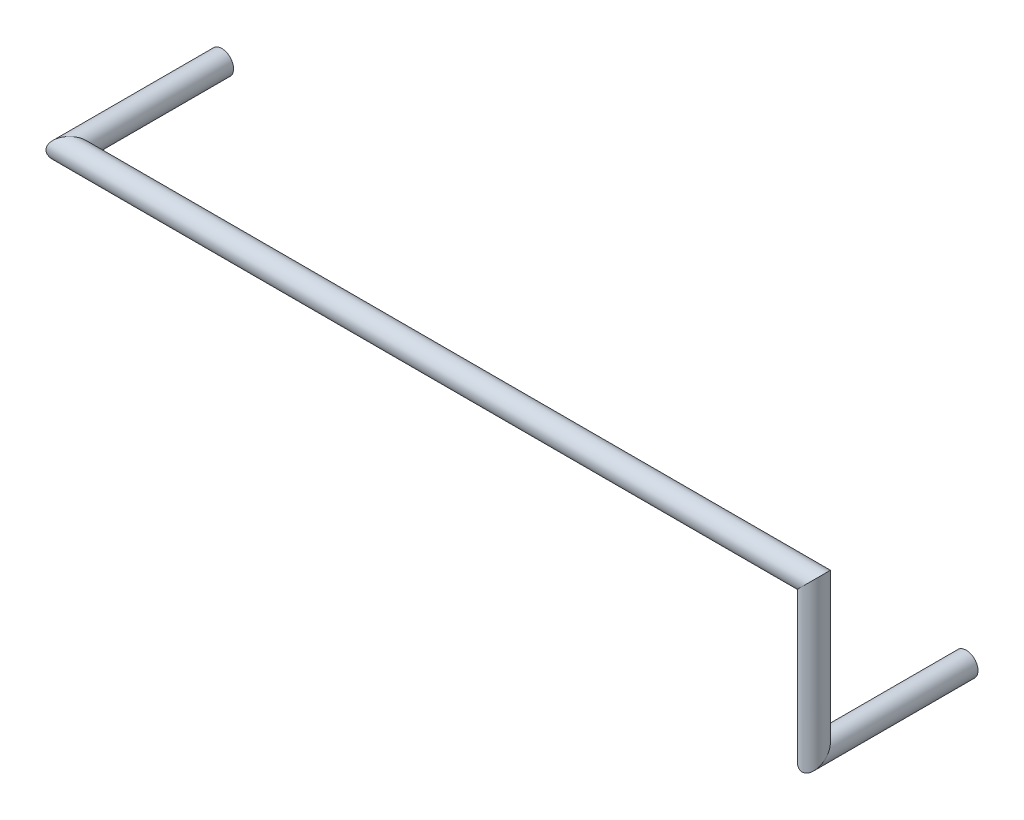
ISO-10303-21;
HEADER;
FILE_DESCRIPTION(('STEP AP214'),'2;1');
FILE_NAME('part.step','',(''),(''),'','','');
FILE_SCHEMA(('AUTOMOTIVE_DESIGN { 1 0 10303 214 1 1 1 1 }'));
ENDSEC;
DATA;
#1=APPLICATION_CONTEXT('core data for automotive mechanical design processes');
#2=APPLICATION_PROTOCOL_DEFINITION('international standard','automotive_design',2000,#1);
#3=PRODUCT_CONTEXT('',#1,'mechanical');
#4=PRODUCT('Part','Part','',(#3));
#5=PRODUCT_RELATED_PRODUCT_CATEGORY('part','',(#4));
#6=PRODUCT_DEFINITION_FORMATION('','',#4);
#7=PRODUCT_DEFINITION_CONTEXT('part definition',#1,'design');
#8=PRODUCT_DEFINITION('design','',#6,#7);
#9=PRODUCT_DEFINITION_SHAPE('','',#8);
#10=(LENGTH_UNIT() NAMED_UNIT(*) SI_UNIT(.MILLI.,.METRE.));
#11=(NAMED_UNIT(*) PLANE_ANGLE_UNIT() SI_UNIT($,.RADIAN.));
#12=(NAMED_UNIT(*) SI_UNIT($,.STERADIAN.) SOLID_ANGLE_UNIT());
#13=UNCERTAINTY_MEASURE_WITH_UNIT(LENGTH_MEASURE(1.E-05),#10,'distance_accuracy_value','');
#14=(GEOMETRIC_REPRESENTATION_CONTEXT(3) GLOBAL_UNCERTAINTY_ASSIGNED_CONTEXT((#13)) GLOBAL_UNIT_ASSIGNED_CONTEXT((#10,
#11,#12)) REPRESENTATION_CONTEXT('',''));
#15=CARTESIAN_POINT('',(0.,0.,0.));
#16=DIRECTION('',(0.,0.,1.));
#17=DIRECTION('',(1.,0.,0.));
#18=AXIS2_PLACEMENT_3D('',#15,#16,#17);
#19=CARTESIAN_POINT('',(-12.7,2.54,0.));
#20=DIRECTION('',(0.,0.,1.));
#21=DIRECTION('',(1.,0.,0.));
#22=AXIS2_PLACEMENT_3D('',#19,#20,#21);
#23=PLANE('',#22);
#24=CARTESIAN_POINT('',(-12.7,2.54,0.));
#25=DIRECTION('',(0.,0.,1.));
#26=DIRECTION('',(1.,0.,0.));
#27=AXIS2_PLACEMENT_3D('',#24,#25,#26);
#28=CIRCLE('',#27,0.200000000000001);
#29=CARTESIAN_POINT('',(-12.5,2.54,0.));
#30=VERTEX_POINT('',#29);
#31=EDGE_CURVE('E58',#30,#30,#28,.T.);
#32=ORIENTED_EDGE('',*,*,#31,.F.);
#33=EDGE_LOOP('',(#32));
#34=FACE_BOUND('',#33,.T.);
#35=ADVANCED_FACE('F55',(#34),#23,.F.);
#36=CARTESIAN_POINT('',(0.,0.,0.));
#37=DIRECTION('',(0.,0.,-1.));
#38=DIRECTION('',(0.,1.,0.));
#39=AXIS2_PLACEMENT_3D('',#36,#37,#38);
#40=PLANE('',#39);
#41=CARTESIAN_POINT('',(0.,0.,0.));
#42=DIRECTION('',(0.,0.,-1.));
#43=DIRECTION('',(0.,1.,0.));
#44=AXIS2_PLACEMENT_3D('',#41,#42,#43);
#45=CIRCLE('',#44,0.200000000000001);
#46=CARTESIAN_POINT('',(0.,0.200000000000001,0.));
#47=VERTEX_POINT('',#46);
#48=EDGE_CURVE('E63',#47,#47,#45,.T.);
#49=ORIENTED_EDGE('',*,*,#48,.T.);
#50=EDGE_LOOP('',(#49));
#51=FACE_BOUND('',#50,.T.);
#52=ADVANCED_FACE('F86',(#51),#40,.T.);
#53=CARTESIAN_POINT('',(-12.7,2.54,2.92));
#54=DIRECTION('',(0.,0.,-1.));
#55=DIRECTION('',(-1.,0.,0.));
#56=AXIS2_PLACEMENT_3D('',#53,#54,#55);
#57=CYLINDRICAL_SURFACE('',#56,0.200000000000001);
#58=CARTESIAN_POINT('',(-12.7,2.54,2.6));
#59=DIRECTION('',(-0.707106781186548,0.,-0.707106781186548));
#60=DIRECTION('',(-0.707106781186548,0.,0.707106781186548));
#61=AXIS2_PLACEMENT_3D('',#58,#59,#60);
#62=ELLIPSE('',#61,0.28284271247462,0.200000000000001);
#63=CARTESIAN_POINT('',(-12.9,2.54,2.8));
#64=VERTEX_POINT('',#63);
#65=EDGE_CURVE('E74',#64,#64,#62,.T.);
#66=ORIENTED_EDGE('',*,*,#65,.T.);
#67=EDGE_LOOP('',(#66));
#68=FACE_BOUND('',#67,.T.);
#69=ORIENTED_EDGE('',*,*,#31,.T.);
#70=EDGE_LOOP('',(#69));
#71=FACE_BOUND('',#70,.T.);
#72=ADVANCED_FACE('F83',(#68,#71),#57,.T.);
#73=CARTESIAN_POINT('',(0.540000000000002,2.54,2.6));
#74=DIRECTION('',(-1.,0.,0.));
#75=DIRECTION('',(0.,-1.,0.));
#76=AXIS2_PLACEMENT_3D('',#73,#74,#75);
#77=CYLINDRICAL_SURFACE('',#76,0.200000000000001);
#78=CARTESIAN_POINT('',(0.,2.54,2.6));
#79=DIRECTION('',(-0.707106781186547,0.707106781186547,0.));
#80=DIRECTION('',(0.707106781186548,0.707106781186548,0.));
#81=AXIS2_PLACEMENT_3D('',#78,#79,#80);
#82=ELLIPSE('',#81,0.28284271247462,0.200000000000001);
#83=CARTESIAN_POINT('',(0.200000000000001,2.74,2.6));
#84=VERTEX_POINT('',#83);
#85=EDGE_CURVE('E69',#84,#84,#82,.T.);
#86=ORIENTED_EDGE('',*,*,#85,.T.);
#87=EDGE_LOOP('',(#86));
#88=FACE_BOUND('',#87,.T.);
#89=ORIENTED_EDGE('',*,*,#65,.F.);
#90=EDGE_LOOP('',(#89));
#91=FACE_BOUND('',#90,.T.);
#92=ADVANCED_FACE('F99',(#88,#91),#77,.T.);
#93=CARTESIAN_POINT('',(0.,-0.320000000000002,2.6));
#94=DIRECTION('',(0.,1.,0.));
#95=DIRECTION('',(0.,0.,1.));
#96=AXIS2_PLACEMENT_3D('',#93,#94,#95);
#97=CYLINDRICAL_SURFACE('',#96,0.200000000000001);
#98=CARTESIAN_POINT('',(0.,0.,2.6));
#99=DIRECTION('',(0.,0.707106781186548,0.707106781186548));
#100=DIRECTION('',(0.,-0.707106781186548,0.707106781186548));
#101=AXIS2_PLACEMENT_3D('',#98,#99,#100);
#102=ELLIPSE('',#101,0.28284271247462,0.200000000000001);
#103=CARTESIAN_POINT('',(0.,-0.200000000000001,2.8));
#104=VERTEX_POINT('',#103);
#105=EDGE_CURVE('E11',#104,#104,#102,.T.);
#106=ORIENTED_EDGE('',*,*,#105,.T.);
#107=EDGE_LOOP('',(#106));
#108=FACE_BOUND('',#107,.T.);
#109=ORIENTED_EDGE('',*,*,#85,.F.);
#110=EDGE_LOOP('',(#109));
#111=FACE_BOUND('',#110,.T.);
#112=ADVANCED_FACE('F93',(#108,#111),#97,.T.);
#113=CARTESIAN_POINT('',(0.,0.,0.));
#114=DIRECTION('',(0.,0.,1.));
#115=DIRECTION('',(1.,0.,0.));
#116=AXIS2_PLACEMENT_3D('',#113,#114,#115);
#117=CYLINDRICAL_SURFACE('',#116,0.200000000000001);
#118=ORIENTED_EDGE('',*,*,#48,.F.);
#119=EDGE_LOOP('',(#118));
#120=FACE_BOUND('',#119,.T.);
#121=ORIENTED_EDGE('',*,*,#105,.F.);
#122=EDGE_LOOP('',(#121));
#123=FACE_BOUND('',#122,.T.);
#124=ADVANCED_FACE('F91',(#120,#123),#117,.T.);
#125=CLOSED_SHELL('',(#35,#52,#72,#92,#112,#124));
#126=MANIFOLD_SOLID_BREP('B2',#125);
#127=ADVANCED_BREP_SHAPE_REPRESENTATION('',(#18,#126),#14);
#128=SHAPE_DEFINITION_REPRESENTATION(#9,#127);
ENDSEC;
END-ISO-10303-21;
